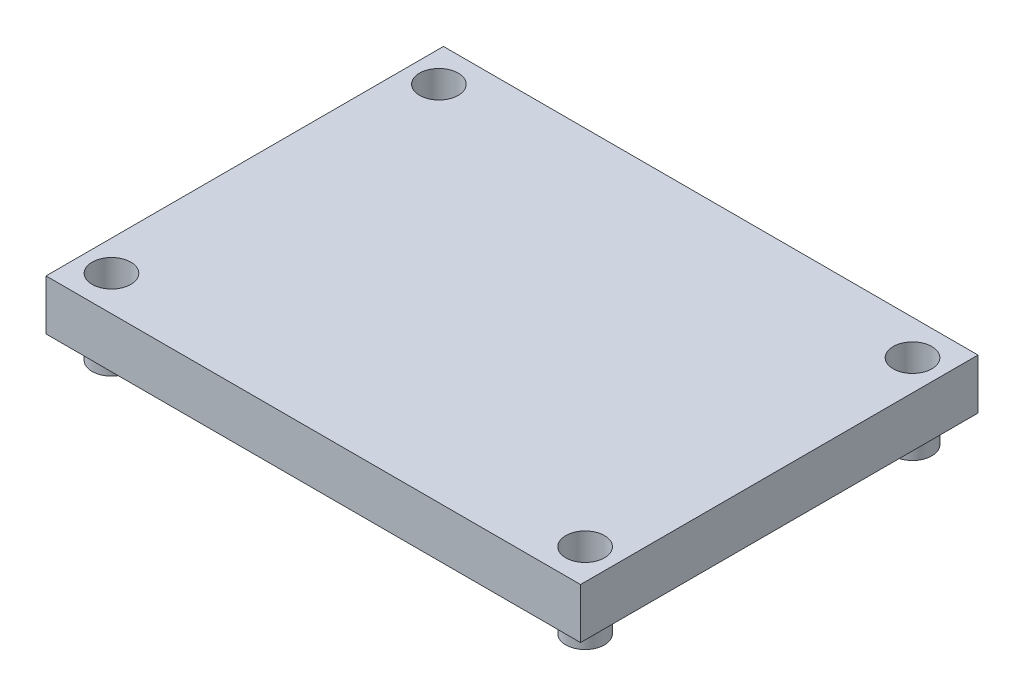
ISO-10303-21;
HEADER;
FILE_DESCRIPTION(('STEP AP214'),'2;1');
FILE_NAME('part.step','',(''),(''),'','','');
FILE_SCHEMA(('AUTOMOTIVE_DESIGN { 1 0 10303 214 1 1 1 1 }'));
ENDSEC;
DATA;
#1=APPLICATION_CONTEXT('core data for automotive mechanical design processes');
#2=APPLICATION_PROTOCOL_DEFINITION('international standard','automotive_design',2000,#1);
#3=PRODUCT_CONTEXT('',#1,'mechanical');
#4=PRODUCT('Part','Part','',(#3));
#5=PRODUCT_RELATED_PRODUCT_CATEGORY('part','',(#4));
#6=PRODUCT_DEFINITION_FORMATION('','',#4);
#7=PRODUCT_DEFINITION_CONTEXT('part definition',#1,'design');
#8=PRODUCT_DEFINITION('design','',#6,#7);
#9=PRODUCT_DEFINITION_SHAPE('','',#8);
#10=(LENGTH_UNIT() NAMED_UNIT(*) SI_UNIT(.MILLI.,.METRE.));
#11=(NAMED_UNIT(*) PLANE_ANGLE_UNIT() SI_UNIT($,.RADIAN.));
#12=(NAMED_UNIT(*) SI_UNIT($,.STERADIAN.) SOLID_ANGLE_UNIT());
#13=UNCERTAINTY_MEASURE_WITH_UNIT(LENGTH_MEASURE(1.E-05),#10,'distance_accuracy_value','');
#14=(GEOMETRIC_REPRESENTATION_CONTEXT(3) GLOBAL_UNCERTAINTY_ASSIGNED_CONTEXT((#13)) GLOBAL_UNIT_ASSIGNED_CONTEXT((#10,
#11,#12)) REPRESENTATION_CONTEXT('',''));
#15=CARTESIAN_POINT('',(0.,0.,0.));
#16=DIRECTION('',(0.,0.,1.));
#17=DIRECTION('',(1.,0.,0.));
#18=AXIS2_PLACEMENT_3D('',#15,#16,#17);
#19=CARTESIAN_POINT('',(4.00000000000001,-3.302,4.59999999999999));
#20=DIRECTION('',(0.,1.,0.));
#21=DIRECTION('',(0.,0.,1.));
#22=AXIS2_PLACEMENT_3D('',#19,#20,#21);
#23=CYLINDRICAL_SURFACE('',#22,2.54);
#24=CARTESIAN_POINT('',(4.00000000000001,-3.302,4.59999999999999));
#25=DIRECTION('',(0.,1.,0.));
#26=DIRECTION('',(0.,0.,1.));
#27=AXIS2_PLACEMENT_3D('',#24,#25,#26);
#28=CIRCLE('',#27,2.54);
#29=CARTESIAN_POINT('',(4.00000000000001,-3.302,7.13999999999999));
#30=VERTEX_POINT('',#29);
#31=EDGE_CURVE('E11',#30,#30,#28,.T.);
#32=ORIENTED_EDGE('',*,*,#31,.T.);
#33=EDGE_LOOP('',(#32));
#34=FACE_BOUND('',#33,.T.);
#35=CARTESIAN_POINT('',(4.00000000000001,0.,4.59999999999999));
#36=DIRECTION('',(0.,1.,0.));
#37=DIRECTION('',(0.,0.,1.));
#38=AXIS2_PLACEMENT_3D('',#35,#36,#37);
#39=CIRCLE('',#38,2.54);
#40=CARTESIAN_POINT('',(4.00000000000001,0.,7.13999999999999));
#41=VERTEX_POINT('',#40);
#42=EDGE_CURVE('E43',#41,#41,#39,.T.);
#43=ORIENTED_EDGE('',*,*,#42,.F.);
#44=EDGE_LOOP('',(#43));
#45=FACE_BOUND('',#44,.T.);
#46=ADVANCED_FACE('F40',(#34,#45),#23,.T.);
#47=CARTESIAN_POINT('',(0.,-3.302,0.));
#48=DIRECTION('',(0.,1.,0.));
#49=DIRECTION('',(0.,0.,1.));
#50=AXIS2_PLACEMENT_3D('',#47,#48,#49);
#51=PLANE('',#50);
#52=ORIENTED_EDGE('',*,*,#31,.F.);
#53=EDGE_LOOP('',(#52));
#54=FACE_BOUND('',#53,.T.);
#55=ADVANCED_FACE('F55',(#54),#51,.F.);
#56=CARTESIAN_POINT('',(0.,0.,0.));
#57=DIRECTION('',(0.,1.,0.));
#58=DIRECTION('',(0.,0.,1.));
#59=AXIS2_PLACEMENT_3D('',#56,#57,#58);
#60=PLANE('',#59);
#61=ORIENTED_EDGE('',*,*,#42,.T.);
#62=EDGE_LOOP('',(#61));
#63=FACE_BOUND('',#62,.T.);
#64=ADVANCED_FACE('F52',(#63),#60,.T.);
#65=CLOSED_SHELL('',(#46,#55,#64));
#66=MANIFOLD_SOLID_BREP('B2',#65);
#67=CARTESIAN_POINT('',(4.00000000000001,-3.302,47.6));
#68=DIRECTION('',(0.,1.,0.));
#69=DIRECTION('',(0.,0.,1.));
#70=AXIS2_PLACEMENT_3D('',#67,#68,#69);
#71=CYLINDRICAL_SURFACE('',#70,2.54);
#72=CARTESIAN_POINT('',(4.00000000000001,-3.302,47.6));
#73=DIRECTION('',(0.,1.,0.));
#74=DIRECTION('',(0.,0.,1.));
#75=AXIS2_PLACEMENT_3D('',#72,#73,#74);
#76=CIRCLE('',#75,2.54);
#77=CARTESIAN_POINT('',(4.00000000000001,-3.302,50.14));
#78=VERTEX_POINT('',#77);
#79=EDGE_CURVE('E39',#78,#78,#76,.T.);
#80=ORIENTED_EDGE('',*,*,#79,.T.);
#81=EDGE_LOOP('',(#80));
#82=FACE_BOUND('',#81,.T.);
#83=CARTESIAN_POINT('',(4.00000000000001,0.,47.6));
#84=DIRECTION('',(0.,1.,0.));
#85=DIRECTION('',(0.,0.,1.));
#86=AXIS2_PLACEMENT_3D('',#83,#84,#85);
#87=CIRCLE('',#86,2.54);
#88=CARTESIAN_POINT('',(4.00000000000001,0.,50.14));
#89=VERTEX_POINT('',#88);
#90=EDGE_CURVE('E92',#89,#89,#87,.T.);
#91=ORIENTED_EDGE('',*,*,#90,.F.);
#92=EDGE_LOOP('',(#91));
#93=FACE_BOUND('',#92,.T.);
#94=ADVANCED_FACE('F89',(#82,#93),#71,.T.);
#95=CARTESIAN_POINT('',(0.,-3.302,0.));
#96=DIRECTION('',(0.,1.,0.));
#97=DIRECTION('',(0.,0.,1.));
#98=AXIS2_PLACEMENT_3D('',#95,#96,#97);
#99=PLANE('',#98);
#100=ORIENTED_EDGE('',*,*,#79,.F.);
#101=EDGE_LOOP('',(#100));
#102=FACE_BOUND('',#101,.T.);
#103=ADVANCED_FACE('F104',(#102),#99,.F.);
#104=CARTESIAN_POINT('',(0.,0.,0.));
#105=DIRECTION('',(0.,1.,0.));
#106=DIRECTION('',(0.,0.,1.));
#107=AXIS2_PLACEMENT_3D('',#104,#105,#106);
#108=PLANE('',#107);
#109=ORIENTED_EDGE('',*,*,#90,.T.);
#110=EDGE_LOOP('',(#109));
#111=FACE_BOUND('',#110,.T.);
#112=ADVANCED_FACE('F101',(#111),#108,.T.);
#113=CLOSED_SHELL('',(#94,#103,#112));
#114=MANIFOLD_SOLID_BREP('B6',#113);
#115=CARTESIAN_POINT('',(66.2,-3.302,47.6));
#116=DIRECTION('',(0.,1.,0.));
#117=DIRECTION('',(0.,0.,1.));
#118=AXIS2_PLACEMENT_3D('',#115,#116,#117);
#119=CYLINDRICAL_SURFACE('',#118,2.54);
#120=CARTESIAN_POINT('',(66.2,-3.302,47.6));
#121=DIRECTION('',(0.,1.,0.));
#122=DIRECTION('',(0.,0.,1.));
#123=AXIS2_PLACEMENT_3D('',#120,#121,#122);
#124=CIRCLE('',#123,2.54);
#125=CARTESIAN_POINT('',(66.2,-3.302,50.14));
#126=VERTEX_POINT('',#125);
#127=EDGE_CURVE('E88',#126,#126,#124,.T.);
#128=ORIENTED_EDGE('',*,*,#127,.T.);
#129=EDGE_LOOP('',(#128));
#130=FACE_BOUND('',#129,.T.);
#131=CARTESIAN_POINT('',(66.2,0.,47.6));
#132=DIRECTION('',(0.,1.,0.));
#133=DIRECTION('',(0.,0.,1.));
#134=AXIS2_PLACEMENT_3D('',#131,#132,#133);
#135=CIRCLE('',#134,2.54);
#136=CARTESIAN_POINT('',(66.2,0.,50.14));
#137=VERTEX_POINT('',#136);
#138=EDGE_CURVE('E141',#137,#137,#135,.T.);
#139=ORIENTED_EDGE('',*,*,#138,.F.);
#140=EDGE_LOOP('',(#139));
#141=FACE_BOUND('',#140,.T.);
#142=ADVANCED_FACE('F138',(#130,#141),#119,.T.);
#143=CARTESIAN_POINT('',(0.,-3.302,0.));
#144=DIRECTION('',(0.,1.,0.));
#145=DIRECTION('',(0.,0.,1.));
#146=AXIS2_PLACEMENT_3D('',#143,#144,#145);
#147=PLANE('',#146);
#148=ORIENTED_EDGE('',*,*,#127,.F.);
#149=EDGE_LOOP('',(#148));
#150=FACE_BOUND('',#149,.T.);
#151=ADVANCED_FACE('F153',(#150),#147,.F.);
#152=CARTESIAN_POINT('',(0.,0.,0.));
#153=DIRECTION('',(0.,1.,0.));
#154=DIRECTION('',(0.,0.,1.));
#155=AXIS2_PLACEMENT_3D('',#152,#153,#154);
#156=PLANE('',#155);
#157=ORIENTED_EDGE('',*,*,#138,.T.);
#158=EDGE_LOOP('',(#157));
#159=FACE_BOUND('',#158,.T.);
#160=ADVANCED_FACE('F150',(#159),#156,.T.);
#161=CLOSED_SHELL('',(#142,#151,#160));
#162=MANIFOLD_SOLID_BREP('B34',#161);
#163=CARTESIAN_POINT('',(66.2,-3.302,4.59999999999999));
#164=DIRECTION('',(0.,1.,0.));
#165=DIRECTION('',(0.,0.,1.));
#166=AXIS2_PLACEMENT_3D('',#163,#164,#165);
#167=CYLINDRICAL_SURFACE('',#166,2.54);
#168=CARTESIAN_POINT('',(66.2,-3.302,4.59999999999999));
#169=DIRECTION('',(0.,1.,0.));
#170=DIRECTION('',(0.,0.,1.));
#171=AXIS2_PLACEMENT_3D('',#168,#169,#170);
#172=CIRCLE('',#171,2.54);
#173=CARTESIAN_POINT('',(66.2,-3.302,7.13999999999998));
#174=VERTEX_POINT('',#173);
#175=EDGE_CURVE('E137',#174,#174,#172,.T.);
#176=ORIENTED_EDGE('',*,*,#175,.T.);
#177=EDGE_LOOP('',(#176));
#178=FACE_BOUND('',#177,.T.);
#179=CARTESIAN_POINT('',(66.2,0.,4.59999999999999));
#180=DIRECTION('',(0.,1.,0.));
#181=DIRECTION('',(0.,0.,1.));
#182=AXIS2_PLACEMENT_3D('',#179,#180,#181);
#183=CIRCLE('',#182,2.54);
#184=CARTESIAN_POINT('',(66.2,0.,7.13999999999998));
#185=VERTEX_POINT('',#184);
#186=EDGE_CURVE('E191',#185,#185,#183,.T.);
#187=ORIENTED_EDGE('',*,*,#186,.F.);
#188=EDGE_LOOP('',(#187));
#189=FACE_BOUND('',#188,.T.);
#190=ADVANCED_FACE('F188',(#178,#189),#167,.T.);
#191=CARTESIAN_POINT('',(0.,-3.302,0.));
#192=DIRECTION('',(0.,1.,0.));
#193=DIRECTION('',(0.,0.,1.));
#194=AXIS2_PLACEMENT_3D('',#191,#192,#193);
#195=PLANE('',#194);
#196=ORIENTED_EDGE('',*,*,#175,.F.);
#197=EDGE_LOOP('',(#196));
#198=FACE_BOUND('',#197,.T.);
#199=ADVANCED_FACE('F203',(#198),#195,.F.);
#200=CARTESIAN_POINT('',(0.,0.,0.));
#201=DIRECTION('',(0.,1.,0.));
#202=DIRECTION('',(0.,0.,1.));
#203=AXIS2_PLACEMENT_3D('',#200,#201,#202);
#204=PLANE('',#203);
#205=ORIENTED_EDGE('',*,*,#186,.T.);
#206=EDGE_LOOP('',(#205));
#207=FACE_BOUND('',#206,.T.);
#208=ADVANCED_FACE('F200',(#207),#204,.T.);
#209=CLOSED_SHELL('',(#190,#199,#208));
#210=MANIFOLD_SOLID_BREP('B83',#209);
#211=CARTESIAN_POINT('',(0.,6.604,0.));
#212=DIRECTION('',(0.,1.,0.));
#213=DIRECTION('',(0.,0.,1.));
#214=AXIS2_PLACEMENT_3D('',#211,#212,#213);
#215=PLANE('',#214);
#216=CARTESIAN_POINT('',(66.2,6.604,47.6));
#217=DIRECTION('',(0.,1.,0.));
#218=DIRECTION('',(0.,0.,1.));
#219=AXIS2_PLACEMENT_3D('',#216,#217,#218);
#220=CIRCLE('',#219,2.54);
#221=CARTESIAN_POINT('',(66.2,6.604,50.14));
#222=VERTEX_POINT('',#221);
#223=EDGE_CURVE('E317',#222,#222,#220,.T.);
#224=ORIENTED_EDGE('',*,*,#223,.F.);
#225=EDGE_LOOP('',(#224));
#226=FACE_BOUND('',#225,.T.);
#227=CARTESIAN_POINT('',(4.00000000000001,6.604,4.59999999999999));
#228=DIRECTION('',(0.,1.,0.));
#229=DIRECTION('',(0.,0.,1.));
#230=AXIS2_PLACEMENT_3D('',#227,#228,#229);
#231=CIRCLE('',#230,2.54);
#232=CARTESIAN_POINT('',(4.00000000000001,6.604,7.13999999999999));
#233=VERTEX_POINT('',#232);
#234=EDGE_CURVE('E296',#233,#233,#231,.T.);
#235=ORIENTED_EDGE('',*,*,#234,.F.);
#236=EDGE_LOOP('',(#235));
#237=FACE_BOUND('',#236,.T.);
#238=DIRECTION('',(0.,0.,1.));
#239=VECTOR('',#238,1.);
#240=CARTESIAN_POINT('',(0.,6.604,0.));
#241=LINE('',#240,#239);
#242=CARTESIAN_POINT('',(0.,6.604,0.));
#243=VERTEX_POINT('',#242);
#244=CARTESIAN_POINT('',(0.,6.604,52.2));
#245=VERTEX_POINT('',#244);
#246=EDGE_CURVE('E281',#243,#245,#241,.T.);
#247=ORIENTED_EDGE('',*,*,#246,.T.);
#248=DIRECTION('',(1.,0.,0.));
#249=VECTOR('',#248,1.);
#250=CARTESIAN_POINT('',(0.,6.604,52.2));
#251=LINE('',#250,#249);
#252=CARTESIAN_POINT('',(70.2,6.604,52.2));
#253=VERTEX_POINT('',#252);
#254=EDGE_CURVE('E276',#245,#253,#251,.T.);
#255=ORIENTED_EDGE('',*,*,#254,.T.);
#256=DIRECTION('',(0.,0.,-1.));
#257=VECTOR('',#256,1.);
#258=CARTESIAN_POINT('',(70.2,6.604,0.));
#259=LINE('',#258,#257);
#260=CARTESIAN_POINT('',(70.2,6.604,0.));
#261=VERTEX_POINT('',#260);
#262=EDGE_CURVE('E279',#253,#261,#259,.T.);
#263=ORIENTED_EDGE('',*,*,#262,.T.);
#264=DIRECTION('',(-1.,0.,0.));
#265=VECTOR('',#264,1.);
#266=CARTESIAN_POINT('',(0.,6.604,0.));
#267=LINE('',#266,#265);
#268=EDGE_CURVE('E246',#261,#243,#267,.T.);
#269=ORIENTED_EDGE('',*,*,#268,.T.);
#270=EDGE_LOOP('',(#247,#255,#263,#269));
#271=FACE_BOUND('',#270,.T.);
#272=CARTESIAN_POINT('',(66.2,6.604,4.59999999999999));
#273=DIRECTION('',(0.,1.,0.));
#274=DIRECTION('',(0.,0.,1.));
#275=AXIS2_PLACEMENT_3D('',#272,#273,#274);
#276=CIRCLE('',#275,2.54);
#277=CARTESIAN_POINT('',(66.2,6.604,7.13999999999998));
#278=VERTEX_POINT('',#277);
#279=EDGE_CURVE('E311',#278,#278,#276,.T.);
#280=ORIENTED_EDGE('',*,*,#279,.F.);
#281=EDGE_LOOP('',(#280));
#282=FACE_BOUND('',#281,.T.);
#283=CARTESIAN_POINT('',(4.00000000000001,6.604,47.6));
#284=DIRECTION('',(0.,1.,0.));
#285=DIRECTION('',(0.,0.,1.));
#286=AXIS2_PLACEMENT_3D('',#283,#284,#285);
#287=CIRCLE('',#286,2.54);
#288=CARTESIAN_POINT('',(4.00000000000001,6.604,50.14));
#289=VERTEX_POINT('',#288);
#290=EDGE_CURVE('E323',#289,#289,#287,.T.);
#291=ORIENTED_EDGE('',*,*,#290,.F.);
#292=EDGE_LOOP('',(#291));
#293=FACE_BOUND('',#292,.T.);
#294=ADVANCED_FACE('F229',(#226,#237,#271,#282,#293),#215,.T.);
#295=CARTESIAN_POINT('',(0.,0.,0.));
#296=DIRECTION('',(0.,1.,0.));
#297=DIRECTION('',(0.,0.,1.));
#298=AXIS2_PLACEMENT_3D('',#295,#296,#297);
#299=PLANE('',#298);
#300=DIRECTION('',(0.,0.,1.));
#301=VECTOR('',#300,1.);
#302=CARTESIAN_POINT('',(0.,0.,0.));
#303=LINE('',#302,#301);
#304=CARTESIAN_POINT('',(0.,0.,0.));
#305=VERTEX_POINT('',#304);
#306=CARTESIAN_POINT('',(0.,0.,52.2));
#307=VERTEX_POINT('',#306);
#308=EDGE_CURVE('E293',#305,#307,#303,.T.);
#309=ORIENTED_EDGE('',*,*,#308,.F.);
#310=DIRECTION('',(-1.,0.,0.));
#311=VECTOR('',#310,1.);
#312=CARTESIAN_POINT('',(0.,0.,0.));
#313=LINE('',#312,#311);
#314=CARTESIAN_POINT('',(70.2,0.,0.));
#315=VERTEX_POINT('',#314);
#316=EDGE_CURVE('E269',#315,#305,#313,.T.);
#317=ORIENTED_EDGE('',*,*,#316,.F.);
#318=DIRECTION('',(0.,0.,-1.));
#319=VECTOR('',#318,1.);
#320=CARTESIAN_POINT('',(70.2,0.,0.));
#321=LINE('',#320,#319);
#322=CARTESIAN_POINT('',(70.2,0.,52.2));
#323=VERTEX_POINT('',#322);
#324=EDGE_CURVE('E263',#323,#315,#321,.T.);
#325=ORIENTED_EDGE('',*,*,#324,.F.);
#326=DIRECTION('',(1.,0.,0.));
#327=VECTOR('',#326,1.);
#328=CARTESIAN_POINT('',(0.,0.,52.2));
#329=LINE('',#328,#327);
#330=EDGE_CURVE('E285',#307,#323,#329,.T.);
#331=ORIENTED_EDGE('',*,*,#330,.F.);
#332=EDGE_LOOP('',(#309,#317,#325,#331));
#333=FACE_BOUND('',#332,.T.);
#334=CARTESIAN_POINT('',(4.00000000000001,0.,4.59999999999999));
#335=DIRECTION('',(0.,1.,0.));
#336=DIRECTION('',(0.,0.,1.));
#337=AXIS2_PLACEMENT_3D('',#334,#335,#336);
#338=CIRCLE('',#337,2.54);
#339=CARTESIAN_POINT('',(4.00000000000001,0.,7.13999999999999));
#340=VERTEX_POINT('',#339);
#341=EDGE_CURVE('E308',#340,#340,#338,.T.);
#342=ORIENTED_EDGE('',*,*,#341,.T.);
#343=EDGE_LOOP('',(#342));
#344=FACE_BOUND('',#343,.T.);
#345=CARTESIAN_POINT('',(66.2,0.,4.59999999999999));
#346=DIRECTION('',(0.,1.,0.));
#347=DIRECTION('',(0.,0.,1.));
#348=AXIS2_PLACEMENT_3D('',#345,#346,#347);
#349=CIRCLE('',#348,2.54);
#350=CARTESIAN_POINT('',(66.2,0.,7.13999999999998));
#351=VERTEX_POINT('',#350);
#352=EDGE_CURVE('E314',#351,#351,#349,.T.);
#353=ORIENTED_EDGE('',*,*,#352,.T.);
#354=EDGE_LOOP('',(#353));
#355=FACE_BOUND('',#354,.T.);
#356=CARTESIAN_POINT('',(66.2,0.,47.6));
#357=DIRECTION('',(0.,1.,0.));
#358=DIRECTION('',(0.,0.,1.));
#359=AXIS2_PLACEMENT_3D('',#356,#357,#358);
#360=CIRCLE('',#359,2.54);
#361=CARTESIAN_POINT('',(66.2,0.,50.14));
#362=VERTEX_POINT('',#361);
#363=EDGE_CURVE('E320',#362,#362,#360,.T.);
#364=ORIENTED_EDGE('',*,*,#363,.T.);
#365=EDGE_LOOP('',(#364));
#366=FACE_BOUND('',#365,.T.);
#367=CARTESIAN_POINT('',(4.00000000000001,0.,47.6));
#368=DIRECTION('',(0.,1.,0.));
#369=DIRECTION('',(0.,0.,1.));
#370=AXIS2_PLACEMENT_3D('',#367,#368,#369);
#371=CIRCLE('',#370,2.54);
#372=CARTESIAN_POINT('',(4.00000000000001,0.,50.14));
#373=VERTEX_POINT('',#372);
#374=EDGE_CURVE('E326',#373,#373,#371,.T.);
#375=ORIENTED_EDGE('',*,*,#374,.T.);
#376=EDGE_LOOP('',(#375));
#377=FACE_BOUND('',#376,.T.);
#378=ADVANCED_FACE('F304',(#333,#344,#355,#366,#377),#299,.F.);
#379=CARTESIAN_POINT('',(0.,6.604,0.));
#380=DIRECTION('',(1.,0.,0.));
#381=DIRECTION('',(0.,0.,-1.));
#382=AXIS2_PLACEMENT_3D('',#379,#380,#381);
#383=PLANE('',#382);
#384=ORIENTED_EDGE('',*,*,#308,.T.);
#385=DIRECTION('',(0.,-1.,0.));
#386=VECTOR('',#385,1.);
#387=CARTESIAN_POINT('',(0.,6.604,52.2));
#388=LINE('',#387,#386);
#389=EDGE_CURVE('E186',#245,#307,#388,.T.);
#390=ORIENTED_EDGE('',*,*,#389,.F.);
#391=ORIENTED_EDGE('',*,*,#246,.F.);
#392=DIRECTION('',(0.,-1.,0.));
#393=VECTOR('',#392,1.);
#394=CARTESIAN_POINT('',(0.,6.604,0.));
#395=LINE('',#394,#393);
#396=EDGE_CURVE('E289',#243,#305,#395,.T.);
#397=ORIENTED_EDGE('',*,*,#396,.T.);
#398=EDGE_LOOP('',(#384,#390,#391,#397));
#399=FACE_BOUND('',#398,.T.);
#400=ADVANCED_FACE('F231',(#399),#383,.F.);
#401=CARTESIAN_POINT('',(0.,6.604,52.2));
#402=DIRECTION('',(0.,0.,-1.));
#403=DIRECTION('',(-1.,0.,0.));
#404=AXIS2_PLACEMENT_3D('',#401,#402,#403);
#405=PLANE('',#404);
#406=ORIENTED_EDGE('',*,*,#330,.T.);
#407=DIRECTION('',(0.,-1.,0.));
#408=VECTOR('',#407,1.);
#409=CARTESIAN_POINT('',(70.2,6.604,52.2));
#410=LINE('',#409,#408);
#411=EDGE_CURVE('E238',#253,#323,#410,.T.);
#412=ORIENTED_EDGE('',*,*,#411,.F.);
#413=ORIENTED_EDGE('',*,*,#254,.F.);
#414=ORIENTED_EDGE('',*,*,#389,.T.);
#415=EDGE_LOOP('',(#406,#412,#413,#414));
#416=FACE_BOUND('',#415,.T.);
#417=ADVANCED_FACE('F284',(#416),#405,.F.);
#418=CARTESIAN_POINT('',(70.2,6.604,0.));
#419=DIRECTION('',(-1.,0.,0.));
#420=DIRECTION('',(0.,0.,1.));
#421=AXIS2_PLACEMENT_3D('',#418,#419,#420);
#422=PLANE('',#421);
#423=ORIENTED_EDGE('',*,*,#324,.T.);
#424=DIRECTION('',(0.,-1.,0.));
#425=VECTOR('',#424,1.);
#426=CARTESIAN_POINT('',(70.2,6.604,0.));
#427=LINE('',#426,#425);
#428=EDGE_CURVE('E286',#261,#315,#427,.T.);
#429=ORIENTED_EDGE('',*,*,#428,.F.);
#430=ORIENTED_EDGE('',*,*,#262,.F.);
#431=ORIENTED_EDGE('',*,*,#411,.T.);
#432=EDGE_LOOP('',(#423,#429,#430,#431));
#433=FACE_BOUND('',#432,.T.);
#434=ADVANCED_FACE('F287',(#433),#422,.F.);
#435=CARTESIAN_POINT('',(0.,6.604,0.));
#436=DIRECTION('',(0.,0.,1.));
#437=DIRECTION('',(1.,0.,0.));
#438=AXIS2_PLACEMENT_3D('',#435,#436,#437);
#439=PLANE('',#438);
#440=ORIENTED_EDGE('',*,*,#316,.T.);
#441=ORIENTED_EDGE('',*,*,#396,.F.);
#442=ORIENTED_EDGE('',*,*,#268,.F.);
#443=ORIENTED_EDGE('',*,*,#428,.T.);
#444=EDGE_LOOP('',(#440,#441,#442,#443));
#445=FACE_BOUND('',#444,.T.);
#446=ADVANCED_FACE('F301',(#445),#439,.F.);
#447=CARTESIAN_POINT('',(4.00000000000001,6.604,4.59999999999999));
#448=DIRECTION('',(0.,-1.,0.));
#449=DIRECTION('',(0.,0.,-1.));
#450=AXIS2_PLACEMENT_3D('',#447,#448,#449);
#451=CYLINDRICAL_SURFACE('',#450,2.54);
#452=ORIENTED_EDGE('',*,*,#234,.T.);
#453=EDGE_LOOP('',(#452));
#454=FACE_BOUND('',#453,.T.);
#455=ORIENTED_EDGE('',*,*,#341,.F.);
#456=EDGE_LOOP('',(#455));
#457=FACE_BOUND('',#456,.T.);
#458=ADVANCED_FACE('F345',(#454,#457),#451,.F.);
#459=CARTESIAN_POINT('',(66.2,6.604,4.59999999999999));
#460=DIRECTION('',(0.,-1.,0.));
#461=DIRECTION('',(0.,0.,-1.));
#462=AXIS2_PLACEMENT_3D('',#459,#460,#461);
#463=CYLINDRICAL_SURFACE('',#462,2.54);
#464=ORIENTED_EDGE('',*,*,#279,.T.);
#465=EDGE_LOOP('',(#464));
#466=FACE_BOUND('',#465,.T.);
#467=ORIENTED_EDGE('',*,*,#352,.F.);
#468=EDGE_LOOP('',(#467));
#469=FACE_BOUND('',#468,.T.);
#470=ADVANCED_FACE('F391',(#466,#469),#463,.F.);
#471=CARTESIAN_POINT('',(66.2,6.604,47.6));
#472=DIRECTION('',(0.,-1.,0.));
#473=DIRECTION('',(0.,0.,-1.));
#474=AXIS2_PLACEMENT_3D('',#471,#472,#473);
#475=CYLINDRICAL_SURFACE('',#474,2.54);
#476=ORIENTED_EDGE('',*,*,#223,.T.);
#477=EDGE_LOOP('',(#476));
#478=FACE_BOUND('',#477,.T.);
#479=ORIENTED_EDGE('',*,*,#363,.F.);
#480=EDGE_LOOP('',(#479));
#481=FACE_BOUND('',#480,.T.);
#482=ADVANCED_FACE('F399',(#478,#481),#475,.F.);
#483=CARTESIAN_POINT('',(4.00000000000001,6.604,47.6));
#484=DIRECTION('',(0.,-1.,0.));
#485=DIRECTION('',(0.,0.,-1.));
#486=AXIS2_PLACEMENT_3D('',#483,#484,#485);
#487=CYLINDRICAL_SURFACE('',#486,2.54);
#488=ORIENTED_EDGE('',*,*,#290,.T.);
#489=EDGE_LOOP('',(#488));
#490=FACE_BOUND('',#489,.T.);
#491=ORIENTED_EDGE('',*,*,#374,.F.);
#492=EDGE_LOOP('',(#491));
#493=FACE_BOUND('',#492,.T.);
#494=ADVANCED_FACE('F332',(#490,#493),#487,.F.);
#495=CLOSED_SHELL('',(#294,#378,#400,#417,#434,#446,#458,#470,#482,#494));
#496=MANIFOLD_SOLID_BREP('B132',#495);
#497=ADVANCED_BREP_SHAPE_REPRESENTATION('',(#18,#66,#114,#162,#210,#496),#14);
#498=SHAPE_DEFINITION_REPRESENTATION(#9,#497);
ENDSEC;
END-ISO-10303-21;
